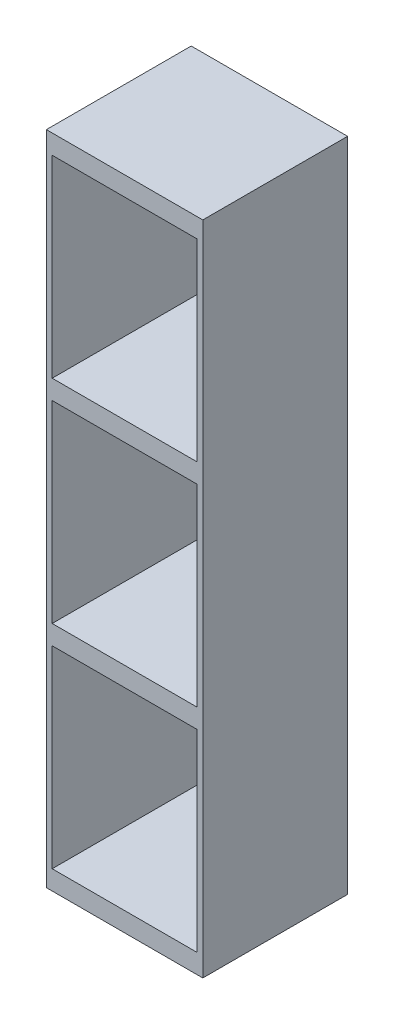
ISO-10303-21;
HEADER;
FILE_DESCRIPTION(('STEP AP214'),'2;1');
FILE_NAME('part.step','',(''),(''),'','','');
FILE_SCHEMA(('AUTOMOTIVE_DESIGN { 1 0 10303 214 1 1 1 1 }'));
ENDSEC;
DATA;
#1=APPLICATION_CONTEXT('core data for automotive mechanical design processes');
#2=APPLICATION_PROTOCOL_DEFINITION('international standard','automotive_design',2000,#1);
#3=PRODUCT_CONTEXT('',#1,'mechanical');
#4=PRODUCT('Part','Part','',(#3));
#5=PRODUCT_RELATED_PRODUCT_CATEGORY('part','',(#4));
#6=PRODUCT_DEFINITION_FORMATION('','',#4);
#7=PRODUCT_DEFINITION_CONTEXT('part definition',#1,'design');
#8=PRODUCT_DEFINITION('design','',#6,#7);
#9=PRODUCT_DEFINITION_SHAPE('','',#8);
#10=(LENGTH_UNIT() NAMED_UNIT(*) SI_UNIT(.MILLI.,.METRE.));
#11=(NAMED_UNIT(*) PLANE_ANGLE_UNIT() SI_UNIT($,.RADIAN.));
#12=(NAMED_UNIT(*) SI_UNIT($,.STERADIAN.) SOLID_ANGLE_UNIT());
#13=UNCERTAINTY_MEASURE_WITH_UNIT(LENGTH_MEASURE(1.E-05),#10,'distance_accuracy_value','');
#14=(GEOMETRIC_REPRESENTATION_CONTEXT(3) GLOBAL_UNCERTAINTY_ASSIGNED_CONTEXT((#13)) GLOBAL_UNIT_ASSIGNED_CONTEXT((#10,
#11,#12)) REPRESENTATION_CONTEXT('',''));
#15=CARTESIAN_POINT('',(0.,0.,0.));
#16=DIRECTION('',(0.,0.,1.));
#17=DIRECTION('',(1.,0.,0.));
#18=AXIS2_PLACEMENT_3D('',#15,#16,#17);
#19=CARTESIAN_POINT('',(37.5,340.,0.));
#20=DIRECTION('',(-1.,0.,0.));
#21=DIRECTION('',(0.,0.,1.));
#22=AXIS2_PLACEMENT_3D('',#19,#20,#21);
#23=PLANE('',#22);
#24=DIRECTION('',(0.,-1.,0.));
#25=VECTOR('',#24,1.);
#26=CARTESIAN_POINT('',(37.5,340.,37.5));
#27=LINE('',#26,#25);
#28=CARTESIAN_POINT('',(37.5,330.,37.5));
#29=VERTEX_POINT('',#28);
#30=CARTESIAN_POINT('',(37.5,230.,37.5));
#31=VERTEX_POINT('',#30);
#32=EDGE_CURVE('E57',#29,#31,#27,.T.);
#33=ORIENTED_EDGE('',*,*,#32,.F.);
#34=DIRECTION('',(0.,0.,-1.));
#35=VECTOR('',#34,1.);
#36=CARTESIAN_POINT('',(37.5,330.,0.));
#37=LINE('',#36,#35);
#38=CARTESIAN_POINT('',(37.5,330.,-37.5));
#39=VERTEX_POINT('',#38);
#40=EDGE_CURVE('E52',#29,#39,#37,.T.);
#41=ORIENTED_EDGE('',*,*,#40,.T.);
#42=DIRECTION('',(0.,-1.,0.));
#43=VECTOR('',#42,1.);
#44=CARTESIAN_POINT('',(37.5,340.,-37.5));
#45=LINE('',#44,#43);
#46=CARTESIAN_POINT('',(37.5,230.,-37.5));
#47=VERTEX_POINT('',#46);
#48=EDGE_CURVE('E244',#39,#47,#45,.T.);
#49=ORIENTED_EDGE('',*,*,#48,.T.);
#50=DIRECTION('',(0.,0.,-1.));
#51=VECTOR('',#50,1.);
#52=CARTESIAN_POINT('',(37.5,230.,0.));
#53=LINE('',#52,#51);
#54=EDGE_CURVE('E192',#31,#47,#53,.T.);
#55=ORIENTED_EDGE('',*,*,#54,.F.);
#56=EDGE_LOOP('',(#33,#41,#49,#55));
#57=FACE_BOUND('',#56,.T.);
#58=ADVANCED_FACE('F35',(#57),#23,.T.);
#59=CARTESIAN_POINT('',(37.5,220.,37.5));
#60=VERTEX_POINT('',#59);
#61=CARTESIAN_POINT('',(37.5,120.,37.5));
#62=VERTEX_POINT('',#61);
#63=EDGE_CURVE('E243',#60,#62,#27,.T.);
#64=ORIENTED_EDGE('',*,*,#63,.F.);
#65=DIRECTION('',(0.,0.,-1.));
#66=VECTOR('',#65,1.);
#67=CARTESIAN_POINT('',(37.5,220.,0.));
#68=LINE('',#67,#66);
#69=CARTESIAN_POINT('',(37.5,220.,-37.5));
#70=VERTEX_POINT('',#69);
#71=EDGE_CURVE('E204',#60,#70,#68,.T.);
#72=ORIENTED_EDGE('',*,*,#71,.T.);
#73=CARTESIAN_POINT('',(37.5,120.,-37.5));
#74=VERTEX_POINT('',#73);
#75=EDGE_CURVE('E247',#70,#74,#45,.T.);
#76=ORIENTED_EDGE('',*,*,#75,.T.);
#77=DIRECTION('',(0.,0.,-1.));
#78=VECTOR('',#77,1.);
#79=CARTESIAN_POINT('',(37.5,120.,0.));
#80=LINE('',#79,#78);
#81=EDGE_CURVE('E214',#62,#74,#80,.T.);
#82=ORIENTED_EDGE('',*,*,#81,.F.);
#83=EDGE_LOOP('',(#64,#72,#76,#82));
#84=FACE_BOUND('',#83,.T.);
#85=ADVANCED_FACE('F305',(#84),#23,.T.);
#86=CARTESIAN_POINT('',(37.5,110.,37.5));
#87=VERTEX_POINT('',#86);
#88=CARTESIAN_POINT('',(37.5,10.,37.5));
#89=VERTEX_POINT('',#88);
#90=EDGE_CURVE('E240',#87,#89,#27,.T.);
#91=ORIENTED_EDGE('',*,*,#90,.F.);
#92=DIRECTION('',(0.,0.,-1.));
#93=VECTOR('',#92,1.);
#94=CARTESIAN_POINT('',(37.5,110.,0.));
#95=LINE('',#94,#93);
#96=CARTESIAN_POINT('',(37.5,110.,-37.5));
#97=VERTEX_POINT('',#96);
#98=EDGE_CURVE('E226',#87,#97,#95,.T.);
#99=ORIENTED_EDGE('',*,*,#98,.T.);
#100=CARTESIAN_POINT('',(37.5,10.,-37.5));
#101=VERTEX_POINT('',#100);
#102=EDGE_CURVE('E242',#97,#101,#45,.T.);
#103=ORIENTED_EDGE('',*,*,#102,.T.);
#104=DIRECTION('',(0.,0.,-1.));
#105=VECTOR('',#104,1.);
#106=CARTESIAN_POINT('',(37.5,10.,0.));
#107=LINE('',#106,#105);
#108=EDGE_CURVE('E253',#89,#101,#107,.T.);
#109=ORIENTED_EDGE('',*,*,#108,.F.);
#110=EDGE_LOOP('',(#91,#99,#103,#109));
#111=FACE_BOUND('',#110,.T.);
#112=ADVANCED_FACE('F307',(#111),#23,.T.);
#113=CARTESIAN_POINT('',(0.,10.,37.5));
#114=DIRECTION('',(0.,0.,-1.));
#115=DIRECTION('',(-1.,0.,0.));
#116=AXIS2_PLACEMENT_3D('',#113,#114,#115);
#117=PLANE('',#116);
#118=DIRECTION('',(0.,-1.,0.));
#119=VECTOR('',#118,1.);
#120=CARTESIAN_POINT('',(-40.5,340.,37.5));
#121=LINE('',#120,#119);
#122=CARTESIAN_POINT('',(-40.5,340.,37.5));
#123=VERTEX_POINT('',#122);
#124=CARTESIAN_POINT('',(-40.5,0.,37.5));
#125=VERTEX_POINT('',#124);
#126=EDGE_CURVE('E166',#123,#125,#121,.T.);
#127=ORIENTED_EDGE('',*,*,#126,.T.);
#128=DIRECTION('',(1.,0.,0.));
#129=VECTOR('',#128,1.);
#130=CARTESIAN_POINT('',(0.,0.,37.5));
#131=LINE('',#130,#129);
#132=CARTESIAN_POINT('',(40.5,0.,37.5));
#133=VERTEX_POINT('',#132);
#134=EDGE_CURVE('E249',#125,#133,#131,.T.);
#135=ORIENTED_EDGE('',*,*,#134,.T.);
#136=DIRECTION('',(0.,-1.,0.));
#137=VECTOR('',#136,1.);
#138=CARTESIAN_POINT('',(40.5,340.,37.5));
#139=LINE('',#138,#137);
#140=CARTESIAN_POINT('',(40.5,340.,37.5));
#141=VERTEX_POINT('',#140);
#142=EDGE_CURVE('E235',#141,#133,#139,.T.);
#143=ORIENTED_EDGE('',*,*,#142,.F.);
#144=DIRECTION('',(1.,0.,0.));
#145=VECTOR('',#144,1.);
#146=CARTESIAN_POINT('',(0.,340.,37.5));
#147=LINE('',#146,#145);
#148=EDGE_CURVE('E158',#123,#141,#147,.T.);
#149=ORIENTED_EDGE('',*,*,#148,.F.);
#150=EDGE_LOOP('',(#127,#135,#143,#149));
#151=FACE_BOUND('',#150,.T.);
#152=DIRECTION('',(0.,-1.,0.));
#153=VECTOR('',#152,1.);
#154=CARTESIAN_POINT('',(-37.5,340.,37.5));
#155=LINE('',#154,#153);
#156=CARTESIAN_POINT('',(-37.5,110.,37.5));
#157=VERTEX_POINT('',#156);
#158=CARTESIAN_POINT('',(-37.5,10.,37.5));
#159=VERTEX_POINT('',#158);
#160=EDGE_CURVE('E270',#157,#159,#155,.T.);
#161=ORIENTED_EDGE('',*,*,#160,.F.);
#162=DIRECTION('',(1.,0.,0.));
#163=VECTOR('',#162,1.);
#164=CARTESIAN_POINT('',(0.,110.,37.5));
#165=LINE('',#164,#163);
#166=EDGE_CURVE('E201',#157,#87,#165,.T.);
#167=ORIENTED_EDGE('',*,*,#166,.T.);
#168=ORIENTED_EDGE('',*,*,#90,.T.);
#169=DIRECTION('',(1.,0.,0.));
#170=VECTOR('',#169,1.);
#171=CARTESIAN_POINT('',(0.,10.,37.5));
#172=LINE('',#171,#170);
#173=EDGE_CURVE('E250',#159,#89,#172,.T.);
#174=ORIENTED_EDGE('',*,*,#173,.F.);
#175=EDGE_LOOP('',(#161,#167,#168,#174));
#176=FACE_BOUND('',#175,.T.);
#177=CARTESIAN_POINT('',(-37.5,220.,37.5));
#178=VERTEX_POINT('',#177);
#179=CARTESIAN_POINT('',(-37.5,120.,37.5));
#180=VERTEX_POINT('',#179);
#181=EDGE_CURVE('E271',#178,#180,#155,.T.);
#182=ORIENTED_EDGE('',*,*,#181,.F.);
#183=DIRECTION('',(1.,0.,0.));
#184=VECTOR('',#183,1.);
#185=CARTESIAN_POINT('',(0.,220.,37.5));
#186=LINE('',#185,#184);
#187=EDGE_CURVE('E188',#178,#60,#186,.T.);
#188=ORIENTED_EDGE('',*,*,#187,.T.);
#189=ORIENTED_EDGE('',*,*,#63,.T.);
#190=DIRECTION('',(1.,0.,0.));
#191=VECTOR('',#190,1.);
#192=CARTESIAN_POINT('',(0.,120.,37.5));
#193=LINE('',#192,#191);
#194=EDGE_CURVE('E211',#180,#62,#193,.T.);
#195=ORIENTED_EDGE('',*,*,#194,.F.);
#196=EDGE_LOOP('',(#182,#188,#189,#195));
#197=FACE_BOUND('',#196,.T.);
#198=DIRECTION('',(1.,0.,0.));
#199=VECTOR('',#198,1.);
#200=CARTESIAN_POINT('',(0.,230.,37.5));
#201=LINE('',#200,#199);
#202=CARTESIAN_POINT('',(-37.5,230.,37.5));
#203=VERTEX_POINT('',#202);
#204=EDGE_CURVE('E189',#203,#31,#201,.T.);
#205=ORIENTED_EDGE('',*,*,#204,.F.);
#206=CARTESIAN_POINT('',(-37.5,330.,37.5));
#207=VERTEX_POINT('',#206);
#208=EDGE_CURVE('E177',#207,#203,#155,.T.);
#209=ORIENTED_EDGE('',*,*,#208,.F.);
#210=DIRECTION('',(1.,0.,0.));
#211=VECTOR('',#210,1.);
#212=CARTESIAN_POINT('',(0.,330.,37.5));
#213=LINE('',#212,#211);
#214=EDGE_CURVE('E173',#207,#29,#213,.T.);
#215=ORIENTED_EDGE('',*,*,#214,.T.);
#216=ORIENTED_EDGE('',*,*,#32,.T.);
#217=EDGE_LOOP('',(#205,#209,#215,#216));
#218=FACE_BOUND('',#217,.T.);
#219=ADVANCED_FACE('F37',(#151,#176,#197,#218),#117,.F.);
#220=CARTESIAN_POINT('',(0.,10.,-37.5));
#221=DIRECTION('',(0.,0.,-1.));
#222=DIRECTION('',(-1.,0.,0.));
#223=AXIS2_PLACEMENT_3D('',#220,#221,#222);
#224=PLANE('',#223);
#225=DIRECTION('',(1.,0.,0.));
#226=VECTOR('',#225,1.);
#227=CARTESIAN_POINT('',(0.,0.,-37.5));
#228=LINE('',#227,#226);
#229=CARTESIAN_POINT('',(-40.5,0.,-37.5));
#230=VERTEX_POINT('',#229);
#231=CARTESIAN_POINT('',(40.5,0.,-37.5));
#232=VERTEX_POINT('',#231);
#233=EDGE_CURVE('E39',#230,#232,#228,.T.);
#234=ORIENTED_EDGE('',*,*,#233,.F.);
#235=DIRECTION('',(0.,-1.,0.));
#236=VECTOR('',#235,1.);
#237=CARTESIAN_POINT('',(-40.5,340.,-37.5));
#238=LINE('',#237,#236);
#239=CARTESIAN_POINT('',(-40.5,340.,-37.5));
#240=VERTEX_POINT('',#239);
#241=EDGE_CURVE('E164',#240,#230,#238,.T.);
#242=ORIENTED_EDGE('',*,*,#241,.F.);
#243=DIRECTION('',(1.,0.,0.));
#244=VECTOR('',#243,1.);
#245=CARTESIAN_POINT('',(0.,340.,-37.5));
#246=LINE('',#245,#244);
#247=CARTESIAN_POINT('',(40.5,340.,-37.5));
#248=VERTEX_POINT('',#247);
#249=EDGE_CURVE('E148',#240,#248,#246,.T.);
#250=ORIENTED_EDGE('',*,*,#249,.T.);
#251=DIRECTION('',(0.,-1.,0.));
#252=VECTOR('',#251,1.);
#253=CARTESIAN_POINT('',(40.5,340.,-37.5));
#254=LINE('',#253,#252);
#255=EDGE_CURVE('E246',#248,#232,#254,.T.);
#256=ORIENTED_EDGE('',*,*,#255,.T.);
#257=EDGE_LOOP('',(#234,#242,#250,#256));
#258=FACE_BOUND('',#257,.T.);
#259=DIRECTION('',(1.,0.,0.));
#260=VECTOR('',#259,1.);
#261=CARTESIAN_POINT('',(0.,110.,-37.5));
#262=LINE('',#261,#260);
#263=CARTESIAN_POINT('',(-37.5,110.,-37.5));
#264=VERTEX_POINT('',#263);
#265=EDGE_CURVE('E229',#264,#97,#262,.T.);
#266=ORIENTED_EDGE('',*,*,#265,.F.);
#267=DIRECTION('',(0.,-1.,0.));
#268=VECTOR('',#267,1.);
#269=CARTESIAN_POINT('',(-37.5,340.,-37.5));
#270=LINE('',#269,#268);
#271=CARTESIAN_POINT('',(-37.5,10.,-37.5));
#272=VERTEX_POINT('',#271);
#273=EDGE_CURVE('E167',#264,#272,#270,.T.);
#274=ORIENTED_EDGE('',*,*,#273,.T.);
#275=DIRECTION('',(1.,0.,0.));
#276=VECTOR('',#275,1.);
#277=CARTESIAN_POINT('',(0.,10.,-37.5));
#278=LINE('',#277,#276);
#279=EDGE_CURVE('E44',#272,#101,#278,.T.);
#280=ORIENTED_EDGE('',*,*,#279,.T.);
#281=ORIENTED_EDGE('',*,*,#102,.F.);
#282=EDGE_LOOP('',(#266,#274,#280,#281));
#283=FACE_BOUND('',#282,.T.);
#284=DIRECTION('',(1.,0.,0.));
#285=VECTOR('',#284,1.);
#286=CARTESIAN_POINT('',(0.,220.,-37.5));
#287=LINE('',#286,#285);
#288=CARTESIAN_POINT('',(-37.5,220.,-37.5));
#289=VERTEX_POINT('',#288);
#290=EDGE_CURVE('E207',#289,#70,#287,.T.);
#291=ORIENTED_EDGE('',*,*,#290,.F.);
#292=CARTESIAN_POINT('',(-37.5,120.,-37.5));
#293=VERTEX_POINT('',#292);
#294=EDGE_CURVE('E268',#289,#293,#270,.T.);
#295=ORIENTED_EDGE('',*,*,#294,.T.);
#296=DIRECTION('',(1.,0.,0.));
#297=VECTOR('',#296,1.);
#298=CARTESIAN_POINT('',(0.,120.,-37.5));
#299=LINE('',#298,#297);
#300=EDGE_CURVE('E218',#293,#74,#299,.T.);
#301=ORIENTED_EDGE('',*,*,#300,.T.);
#302=ORIENTED_EDGE('',*,*,#75,.F.);
#303=EDGE_LOOP('',(#291,#295,#301,#302));
#304=FACE_BOUND('',#303,.T.);
#305=CARTESIAN_POINT('',(-37.5,330.,-37.5));
#306=VERTEX_POINT('',#305);
#307=CARTESIAN_POINT('',(-37.5,230.,-37.5));
#308=VERTEX_POINT('',#307);
#309=EDGE_CURVE('E269',#306,#308,#270,.T.);
#310=ORIENTED_EDGE('',*,*,#309,.T.);
#311=DIRECTION('',(1.,0.,0.));
#312=VECTOR('',#311,1.);
#313=CARTESIAN_POINT('',(0.,230.,-37.5));
#314=LINE('',#313,#312);
#315=EDGE_CURVE('E196',#308,#47,#314,.T.);
#316=ORIENTED_EDGE('',*,*,#315,.T.);
#317=ORIENTED_EDGE('',*,*,#48,.F.);
#318=DIRECTION('',(1.,0.,0.));
#319=VECTOR('',#318,1.);
#320=CARTESIAN_POINT('',(0.,330.,-37.5));
#321=LINE('',#320,#319);
#322=EDGE_CURVE('E182',#306,#39,#321,.T.);
#323=ORIENTED_EDGE('',*,*,#322,.F.);
#324=EDGE_LOOP('',(#310,#316,#317,#323));
#325=FACE_BOUND('',#324,.T.);
#326=ADVANCED_FACE('F170',(#258,#283,#304,#325),#224,.T.);
#327=CARTESIAN_POINT('',(0.,10.,0.));
#328=DIRECTION('',(0.,1.,0.));
#329=DIRECTION('',(0.,0.,1.));
#330=AXIS2_PLACEMENT_3D('',#327,#328,#329);
#331=PLANE('',#330);
#332=ORIENTED_EDGE('',*,*,#173,.T.);
#333=ORIENTED_EDGE('',*,*,#108,.T.);
#334=ORIENTED_EDGE('',*,*,#279,.F.);
#335=DIRECTION('',(0.,0.,-1.));
#336=VECTOR('',#335,1.);
#337=CARTESIAN_POINT('',(-37.5,10.,0.));
#338=LINE('',#337,#336);
#339=EDGE_CURVE('E11',#159,#272,#338,.T.);
#340=ORIENTED_EDGE('',*,*,#339,.F.);
#341=EDGE_LOOP('',(#332,#333,#334,#340));
#342=FACE_BOUND('',#341,.T.);
#343=ADVANCED_FACE('F338',(#342),#331,.T.);
#344=CARTESIAN_POINT('',(0.,0.,0.));
#345=DIRECTION('',(0.,1.,0.));
#346=DIRECTION('',(0.,0.,1.));
#347=AXIS2_PLACEMENT_3D('',#344,#345,#346);
#348=PLANE('',#347);
#349=ORIENTED_EDGE('',*,*,#134,.F.);
#350=DIRECTION('',(0.,0.,1.));
#351=VECTOR('',#350,1.);
#352=CARTESIAN_POINT('',(-40.5,0.,0.));
#353=LINE('',#352,#351);
#354=EDGE_CURVE('E168',#230,#125,#353,.T.);
#355=ORIENTED_EDGE('',*,*,#354,.F.);
#356=ORIENTED_EDGE('',*,*,#233,.T.);
#357=DIRECTION('',(0.,0.,1.));
#358=VECTOR('',#357,1.);
#359=CARTESIAN_POINT('',(40.5,0.,0.));
#360=LINE('',#359,#358);
#361=EDGE_CURVE('E223',#232,#133,#360,.T.);
#362=ORIENTED_EDGE('',*,*,#361,.T.);
#363=EDGE_LOOP('',(#349,#355,#356,#362));
#364=FACE_BOUND('',#363,.T.);
#365=ADVANCED_FACE('F260',(#364),#348,.F.);
#366=CARTESIAN_POINT('',(40.5,340.,0.));
#367=DIRECTION('',(1.,0.,0.));
#368=DIRECTION('',(0.,0.,-1.));
#369=AXIS2_PLACEMENT_3D('',#366,#367,#368);
#370=PLANE('',#369);
#371=ORIENTED_EDGE('',*,*,#361,.F.);
#372=ORIENTED_EDGE('',*,*,#255,.F.);
#373=DIRECTION('',(0.,0.,1.));
#374=VECTOR('',#373,1.);
#375=CARTESIAN_POINT('',(40.5,340.,0.));
#376=LINE('',#375,#374);
#377=EDGE_CURVE('E154',#248,#141,#376,.T.);
#378=ORIENTED_EDGE('',*,*,#377,.T.);
#379=ORIENTED_EDGE('',*,*,#142,.T.);
#380=EDGE_LOOP('',(#371,#372,#378,#379));
#381=FACE_BOUND('',#380,.T.);
#382=ADVANCED_FACE('F263',(#381),#370,.T.);
#383=CARTESIAN_POINT('',(0.,340.,0.));
#384=DIRECTION('',(0.,1.,0.));
#385=DIRECTION('',(0.,0.,1.));
#386=AXIS2_PLACEMENT_3D('',#383,#384,#385);
#387=PLANE('',#386);
#388=ORIENTED_EDGE('',*,*,#377,.F.);
#389=ORIENTED_EDGE('',*,*,#249,.F.);
#390=DIRECTION('',(0.,0.,1.));
#391=VECTOR('',#390,1.);
#392=CARTESIAN_POINT('',(-40.5,340.,0.));
#393=LINE('',#392,#391);
#394=EDGE_CURVE('E151',#240,#123,#393,.T.);
#395=ORIENTED_EDGE('',*,*,#394,.T.);
#396=ORIENTED_EDGE('',*,*,#148,.T.);
#397=EDGE_LOOP('',(#388,#389,#395,#396));
#398=FACE_BOUND('',#397,.T.);
#399=ADVANCED_FACE('F150',(#398),#387,.T.);
#400=CARTESIAN_POINT('',(0.,120.,0.));
#401=DIRECTION('',(0.,1.,0.));
#402=DIRECTION('',(0.,0.,1.));
#403=AXIS2_PLACEMENT_3D('',#400,#401,#402);
#404=PLANE('',#403);
#405=ORIENTED_EDGE('',*,*,#194,.T.);
#406=ORIENTED_EDGE('',*,*,#81,.T.);
#407=ORIENTED_EDGE('',*,*,#300,.F.);
#408=DIRECTION('',(0.,0.,-1.));
#409=VECTOR('',#408,1.);
#410=CARTESIAN_POINT('',(-37.5,120.,0.));
#411=LINE('',#410,#409);
#412=EDGE_CURVE('E221',#180,#293,#411,.T.);
#413=ORIENTED_EDGE('',*,*,#412,.F.);
#414=EDGE_LOOP('',(#405,#406,#407,#413));
#415=FACE_BOUND('',#414,.T.);
#416=ADVANCED_FACE('F330',(#415),#404,.T.);
#417=CARTESIAN_POINT('',(0.,110.,0.));
#418=DIRECTION('',(0.,1.,0.));
#419=DIRECTION('',(0.,0.,1.));
#420=AXIS2_PLACEMENT_3D('',#417,#418,#419);
#421=PLANE('',#420);
#422=ORIENTED_EDGE('',*,*,#166,.F.);
#423=DIRECTION('',(0.,0.,-1.));
#424=VECTOR('',#423,1.);
#425=CARTESIAN_POINT('',(-37.5,110.,0.));
#426=LINE('',#425,#424);
#427=EDGE_CURVE('E215',#157,#264,#426,.T.);
#428=ORIENTED_EDGE('',*,*,#427,.T.);
#429=ORIENTED_EDGE('',*,*,#265,.T.);
#430=ORIENTED_EDGE('',*,*,#98,.F.);
#431=EDGE_LOOP('',(#422,#428,#429,#430));
#432=FACE_BOUND('',#431,.T.);
#433=ADVANCED_FACE('F342',(#432),#421,.F.);
#434=CARTESIAN_POINT('',(0.,230.,0.));
#435=DIRECTION('',(0.,1.,0.));
#436=DIRECTION('',(0.,0.,1.));
#437=AXIS2_PLACEMENT_3D('',#434,#435,#436);
#438=PLANE('',#437);
#439=ORIENTED_EDGE('',*,*,#204,.T.);
#440=ORIENTED_EDGE('',*,*,#54,.T.);
#441=ORIENTED_EDGE('',*,*,#315,.F.);
#442=DIRECTION('',(0.,0.,-1.));
#443=VECTOR('',#442,1.);
#444=CARTESIAN_POINT('',(-37.5,230.,0.));
#445=LINE('',#444,#443);
#446=EDGE_CURVE('E199',#203,#308,#445,.T.);
#447=ORIENTED_EDGE('',*,*,#446,.F.);
#448=EDGE_LOOP('',(#439,#440,#441,#447));
#449=FACE_BOUND('',#448,.T.);
#450=ADVANCED_FACE('F285',(#449),#438,.T.);
#451=CARTESIAN_POINT('',(0.,220.,0.));
#452=DIRECTION('',(0.,1.,0.));
#453=DIRECTION('',(0.,0.,1.));
#454=AXIS2_PLACEMENT_3D('',#451,#452,#453);
#455=PLANE('',#454);
#456=ORIENTED_EDGE('',*,*,#187,.F.);
#457=DIRECTION('',(0.,0.,-1.));
#458=VECTOR('',#457,1.);
#459=CARTESIAN_POINT('',(-37.5,220.,0.));
#460=LINE('',#459,#458);
#461=EDGE_CURVE('E193',#178,#289,#460,.T.);
#462=ORIENTED_EDGE('',*,*,#461,.T.);
#463=ORIENTED_EDGE('',*,*,#290,.T.);
#464=ORIENTED_EDGE('',*,*,#71,.F.);
#465=EDGE_LOOP('',(#456,#462,#463,#464));
#466=FACE_BOUND('',#465,.T.);
#467=ADVANCED_FACE('F292',(#466),#455,.F.);
#468=CARTESIAN_POINT('',(0.,330.,0.));
#469=DIRECTION('',(0.,1.,0.));
#470=DIRECTION('',(0.,0.,1.));
#471=AXIS2_PLACEMENT_3D('',#468,#469,#470);
#472=PLANE('',#471);
#473=ORIENTED_EDGE('',*,*,#214,.F.);
#474=DIRECTION('',(0.,0.,-1.));
#475=VECTOR('',#474,1.);
#476=CARTESIAN_POINT('',(-37.5,330.,0.));
#477=LINE('',#476,#475);
#478=EDGE_CURVE('E185',#207,#306,#477,.T.);
#479=ORIENTED_EDGE('',*,*,#478,.T.);
#480=ORIENTED_EDGE('',*,*,#322,.T.);
#481=ORIENTED_EDGE('',*,*,#40,.F.);
#482=EDGE_LOOP('',(#473,#479,#480,#481));
#483=FACE_BOUND('',#482,.T.);
#484=ADVANCED_FACE('F289',(#483),#472,.F.);
#485=CARTESIAN_POINT('',(-37.5,340.,0.));
#486=DIRECTION('',(-1.,0.,0.));
#487=DIRECTION('',(0.,0.,1.));
#488=AXIS2_PLACEMENT_3D('',#485,#486,#487);
#489=PLANE('',#488);
#490=ORIENTED_EDGE('',*,*,#339,.T.);
#491=ORIENTED_EDGE('',*,*,#273,.F.);
#492=ORIENTED_EDGE('',*,*,#427,.F.);
#493=ORIENTED_EDGE('',*,*,#160,.T.);
#494=EDGE_LOOP('',(#490,#491,#492,#493));
#495=FACE_BOUND('',#494,.T.);
#496=ADVANCED_FACE('F291',(#495),#489,.F.);
#497=ORIENTED_EDGE('',*,*,#412,.T.);
#498=ORIENTED_EDGE('',*,*,#294,.F.);
#499=ORIENTED_EDGE('',*,*,#461,.F.);
#500=ORIENTED_EDGE('',*,*,#181,.T.);
#501=EDGE_LOOP('',(#497,#498,#499,#500));
#502=FACE_BOUND('',#501,.T.);
#503=ADVANCED_FACE('F298',(#502),#489,.F.);
#504=ORIENTED_EDGE('',*,*,#446,.T.);
#505=ORIENTED_EDGE('',*,*,#309,.F.);
#506=ORIENTED_EDGE('',*,*,#478,.F.);
#507=ORIENTED_EDGE('',*,*,#208,.T.);
#508=EDGE_LOOP('',(#504,#505,#506,#507));
#509=FACE_BOUND('',#508,.T.);
#510=ADVANCED_FACE('F279',(#509),#489,.F.);
#511=CARTESIAN_POINT('',(-40.5,340.,0.));
#512=DIRECTION('',(1.,0.,0.));
#513=DIRECTION('',(0.,0.,-1.));
#514=AXIS2_PLACEMENT_3D('',#511,#512,#513);
#515=PLANE('',#514);
#516=ORIENTED_EDGE('',*,*,#354,.T.);
#517=ORIENTED_EDGE('',*,*,#126,.F.);
#518=ORIENTED_EDGE('',*,*,#394,.F.);
#519=ORIENTED_EDGE('',*,*,#241,.T.);
#520=EDGE_LOOP('',(#516,#517,#518,#519));
#521=FACE_BOUND('',#520,.T.);
#522=ADVANCED_FACE('F163',(#521),#515,.F.);
#523=CLOSED_SHELL('',(#58,#85,#112,#219,#326,#343,#365,#382,#399,#416,#433,#450,#467,#484,#496,
#503,#510,#522));
#524=MANIFOLD_SOLID_BREP('B2',#523);
#525=ADVANCED_BREP_SHAPE_REPRESENTATION('',(#18,#524),#14);
#526=SHAPE_DEFINITION_REPRESENTATION(#9,#525);
ENDSEC;
END-ISO-10303-21;
